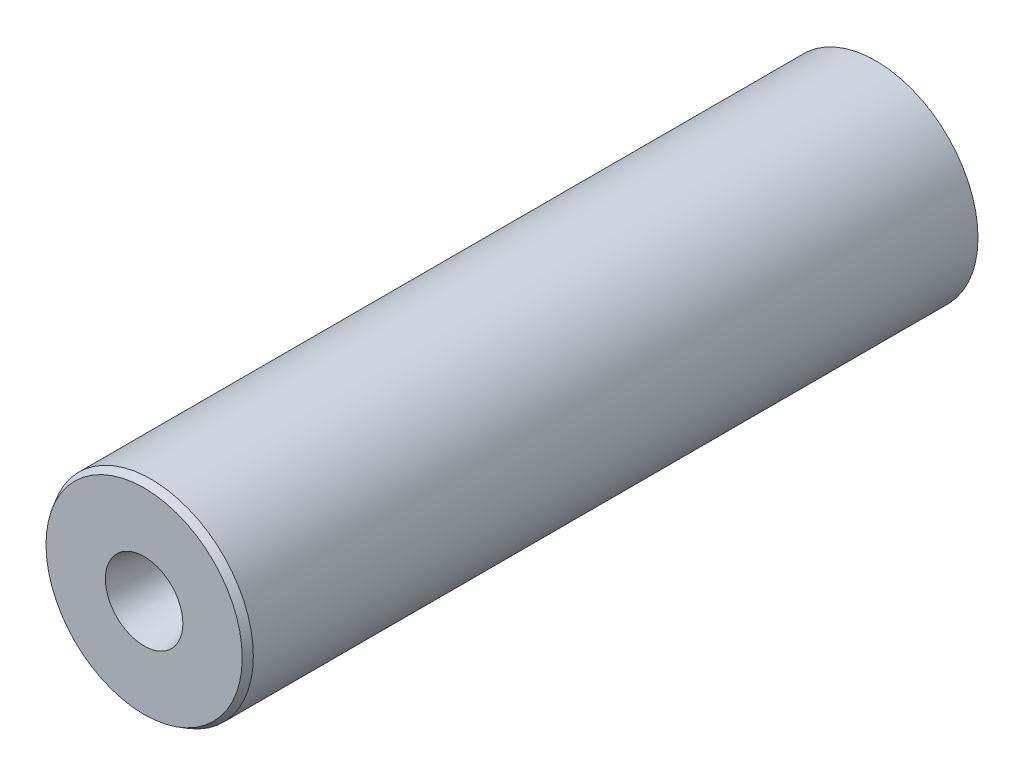
ISO-10303-21;
HEADER;
FILE_DESCRIPTION(('STEP AP214'),'2;1');
FILE_NAME('part.step','',(''),(''),'','','');
FILE_SCHEMA(('AUTOMOTIVE_DESIGN { 1 0 10303 214 1 1 1 1 }'));
ENDSEC;
DATA;
#1=APPLICATION_CONTEXT('core data for automotive mechanical design processes');
#2=APPLICATION_PROTOCOL_DEFINITION('international standard','automotive_design',2000,#1);
#3=PRODUCT_CONTEXT('',#1,'mechanical');
#4=PRODUCT('Part','Part','',(#3));
#5=PRODUCT_RELATED_PRODUCT_CATEGORY('part','',(#4));
#6=PRODUCT_DEFINITION_FORMATION('','',#4);
#7=PRODUCT_DEFINITION_CONTEXT('part definition',#1,'design');
#8=PRODUCT_DEFINITION('design','',#6,#7);
#9=PRODUCT_DEFINITION_SHAPE('','',#8);
#10=(LENGTH_UNIT() NAMED_UNIT(*) SI_UNIT(.MILLI.,.METRE.));
#11=(NAMED_UNIT(*) PLANE_ANGLE_UNIT() SI_UNIT($,.RADIAN.));
#12=(NAMED_UNIT(*) SI_UNIT($,.STERADIAN.) SOLID_ANGLE_UNIT());
#13=UNCERTAINTY_MEASURE_WITH_UNIT(LENGTH_MEASURE(1.E-05),#10,'distance_accuracy_value','');
#14=(GEOMETRIC_REPRESENTATION_CONTEXT(3) GLOBAL_UNCERTAINTY_ASSIGNED_CONTEXT((#13)) GLOBAL_UNIT_ASSIGNED_CONTEXT((#10,
#11,#12)) REPRESENTATION_CONTEXT('',''));
#15=CARTESIAN_POINT('',(0.,0.,0.));
#16=DIRECTION('',(0.,0.,1.));
#17=DIRECTION('',(1.,0.,0.));
#18=AXIS2_PLACEMENT_3D('',#15,#16,#17);
#19=CARTESIAN_POINT('',(0.,0.,51.9181610963858));
#20=DIRECTION('',(0.,0.,1.));
#21=DIRECTION('',(1.,0.,0.));
#22=AXIS2_PLACEMENT_3D('',#19,#20,#21);
#23=CYLINDRICAL_SURFACE('',#22,11.);
#24=CARTESIAN_POINT('',(0.,0.,21.7420929414587));
#25=DIRECTION('',(0.,0.,1.));
#26=DIRECTION('',(1.,0.,0.));
#27=AXIS2_PLACEMENT_3D('',#24,#25,#26);
#28=CIRCLE('',#27,11.);
#29=CARTESIAN_POINT('',(11.,0.,21.7420929414587));
#30=VERTEX_POINT('',#29);
#31=EDGE_CURVE('E54',#30,#30,#28,.T.);
#32=ORIENTED_EDGE('',*,*,#31,.T.);
#33=EDGE_LOOP('',(#32));
#34=FACE_BOUND('',#33,.T.);
#35=CARTESIAN_POINT('',(0.,0.,-36.9181610963857));
#36=DIRECTION('',(0.,0.,-1.));
#37=DIRECTION('',(0.,1.,0.));
#38=AXIS2_PLACEMENT_3D('',#35,#36,#37);
#39=CIRCLE('',#38,11.);
#40=CARTESIAN_POINT('',(0.,11.,-36.9181610963857));
#41=VERTEX_POINT('',#40);
#42=EDGE_CURVE('E58',#41,#41,#39,.F.);
#43=ORIENTED_EDGE('',*,*,#42,.F.);
#44=EDGE_LOOP('',(#43));
#45=FACE_BOUND('',#44,.T.);
#46=ADVANCED_FACE('F31',(#34,#45),#23,.F.);
#47=CARTESIAN_POINT('',(0.,0.,-51.9181610963858));
#48=DIRECTION('',(0.,0.,-1.));
#49=DIRECTION('',(-1.,0.,0.));
#50=AXIS2_PLACEMENT_3D('',#47,#48,#49);
#51=CIRCLE('',#50,11.);
#52=CARTESIAN_POINT('',(-11.,0.,-51.9181610963858));
#53=VERTEX_POINT('',#52);
#54=EDGE_CURVE('E61',#53,#53,#51,.T.);
#55=ORIENTED_EDGE('',*,*,#54,.T.);
#56=EDGE_LOOP('',(#55));
#57=FACE_BOUND('',#56,.T.);
#58=CARTESIAN_POINT('',(0.,0.,-48.9181610963857));
#59=DIRECTION('',(0.,0.,1.));
#60=DIRECTION('',(0.,-1.,0.));
#61=AXIS2_PLACEMENT_3D('',#58,#59,#60);
#62=CIRCLE('',#61,11.);
#63=CARTESIAN_POINT('',(0.,-11.,-48.9181610963857));
#64=VERTEX_POINT('',#63);
#65=EDGE_CURVE('E99',#64,#64,#62,.T.);
#66=ORIENTED_EDGE('',*,*,#65,.T.);
#67=EDGE_LOOP('',(#66));
#68=FACE_BOUND('',#67,.T.);
#69=ADVANCED_FACE('F103',(#57,#68),#23,.F.);
#70=CARTESIAN_POINT('',(0.,14.5,51.9181610963858));
#71=DIRECTION('',(0.,0.,-1.));
#72=DIRECTION('',(-1.,0.,0.));
#73=AXIS2_PLACEMENT_3D('',#70,#71,#72);
#74=PLANE('',#73);
#75=CARTESIAN_POINT('',(0.,0.,51.9181610963858));
#76=DIRECTION('',(0.,0.,-1.));
#77=DIRECTION('',(-1.,0.,0.));
#78=AXIS2_PLACEMENT_3D('',#75,#76,#77);
#79=CIRCLE('',#78,13.9226497308104);
#80=CARTESIAN_POINT('',(-13.9226497308104,0.,51.9181610963858));
#81=VERTEX_POINT('',#80);
#82=EDGE_CURVE('E38',#81,#81,#79,.F.);
#83=ORIENTED_EDGE('',*,*,#82,.T.);
#84=EDGE_LOOP('',(#83));
#85=FACE_BOUND('',#84,.T.);
#86=CARTESIAN_POINT('',(0.,0.,51.9181610963858));
#87=DIRECTION('',(0.,0.,1.));
#88=DIRECTION('',(1.,0.,0.));
#89=AXIS2_PLACEMENT_3D('',#86,#87,#88);
#90=CIRCLE('',#89,5.5);
#91=CARTESIAN_POINT('',(5.5,0.,51.9181610963858));
#92=VERTEX_POINT('',#91);
#93=EDGE_CURVE('E57',#92,#92,#90,.T.);
#94=ORIENTED_EDGE('',*,*,#93,.F.);
#95=EDGE_LOOP('',(#94));
#96=FACE_BOUND('',#95,.T.);
#97=ADVANCED_FACE('F127',(#85,#96),#74,.F.);
#98=CARTESIAN_POINT('',(0.,0.,51.9181610963858));
#99=DIRECTION('',(0.,0.,1.));
#100=DIRECTION('',(1.,0.,0.));
#101=AXIS2_PLACEMENT_3D('',#98,#99,#100);
#102=CONICAL_SURFACE('',#101,5.5,0.209439510239312);
#103=CARTESIAN_POINT('',(0.,0.,39.6816491923393));
#104=DIRECTION('',(0.,0.,-1.));
#105=DIRECTION('',(-1.,0.,0.));
#106=AXIS2_PLACEMENT_3D('',#103,#104,#105);
#107=CIRCLE('',#106,2.89904910284168);
#108=CARTESIAN_POINT('',(-2.89904910284168,0.,39.6816491923393));
#109=VERTEX_POINT('',#108);
#110=EDGE_CURVE('E42',#109,#109,#107,.T.);
#111=ORIENTED_EDGE('',*,*,#110,.T.);
#112=EDGE_LOOP('',(#111));
#113=FACE_BOUND('',#112,.T.);
#114=ORIENTED_EDGE('',*,*,#93,.T.);
#115=EDGE_LOOP('',(#114));
#116=FACE_BOUND('',#115,.T.);
#117=ADVANCED_FACE('F176',(#113,#116),#102,.F.);
#118=CARTESIAN_POINT('',(0.,0.,37.8042707679499));
#119=DIRECTION('',(0.,0.,-1.));
#120=DIRECTION('',(-1.,0.,0.));
#121=AXIS2_PLACEMENT_3D('',#118,#119,#120);
#122=CONICAL_SURFACE('',#121,2.5,0.523598775598293);
#123=CARTESIAN_POINT('',(0.,0.,24.2420929414586));
#124=DIRECTION('',(0.,0.,-1.));
#125=DIRECTION('',(-1.,0.,0.));
#126=AXIS2_PLACEMENT_3D('',#123,#124,#125);
#127=CIRCLE('',#126,10.3301270189222);
#128=CARTESIAN_POINT('',(-10.3301270189222,0.,24.2420929414586));
#129=VERTEX_POINT('',#128);
#130=EDGE_CURVE('E46',#129,#129,#127,.T.);
#131=ORIENTED_EDGE('',*,*,#130,.T.);
#132=EDGE_LOOP('',(#131));
#133=FACE_BOUND('',#132,.T.);
#134=CARTESIAN_POINT('',(0.,0.,36.1420907382506));
#135=DIRECTION('',(0.,0.,1.));
#136=DIRECTION('',(1.,0.,0.));
#137=AXIS2_PLACEMENT_3D('',#134,#135,#136);
#138=CIRCLE('',#137,3.45966008758851);
#139=CARTESIAN_POINT('',(3.45966008758851,0.,36.1420907382506));
#140=VERTEX_POINT('',#139);
#141=EDGE_CURVE('E51',#140,#140,#138,.T.);
#142=ORIENTED_EDGE('',*,*,#141,.T.);
#143=EDGE_LOOP('',(#142));
#144=FACE_BOUND('',#143,.T.);
#145=ADVANCED_FACE('F171',(#133,#144),#122,.F.);
#146=CARTESIAN_POINT('',(0.,14.5,-51.9181610963858));
#147=DIRECTION('',(0.,0.,1.));
#148=DIRECTION('',(1.,0.,0.));
#149=AXIS2_PLACEMENT_3D('',#146,#147,#148);
#150=PLANE('',#149);
#151=ORIENTED_EDGE('',*,*,#54,.F.);
#152=EDGE_LOOP('',(#151));
#153=FACE_BOUND('',#152,.T.);
#154=CARTESIAN_POINT('',(0.,0.,-51.9181610963858));
#155=DIRECTION('',(0.,0.,1.));
#156=DIRECTION('',(1.,0.,0.));
#157=AXIS2_PLACEMENT_3D('',#154,#155,#156);
#158=CIRCLE('',#157,14.5);
#159=CARTESIAN_POINT('',(14.5,0.,-51.9181610963858));
#160=VERTEX_POINT('',#159);
#161=EDGE_CURVE('E65',#160,#160,#158,.T.);
#162=ORIENTED_EDGE('',*,*,#161,.F.);
#163=EDGE_LOOP('',(#162));
#164=FACE_BOUND('',#163,.T.);
#165=ADVANCED_FACE('F169',(#153,#164),#150,.F.);
#166=CARTESIAN_POINT('',(0.,0.,51.9181610963858));
#167=DIRECTION('',(0.,0.,1.));
#168=DIRECTION('',(1.,0.,0.));
#169=AXIS2_PLACEMENT_3D('',#166,#167,#168);
#170=CYLINDRICAL_SURFACE('',#169,14.5);
#171=CARTESIAN_POINT('',(0.,0.,50.9181610963858));
#172=DIRECTION('',(0.,0.,-1.));
#173=DIRECTION('',(-1.,0.,0.));
#174=AXIS2_PLACEMENT_3D('',#171,#172,#173);
#175=CIRCLE('',#174,14.5);
#176=CARTESIAN_POINT('',(-14.5,0.,50.9181610963858));
#177=VERTEX_POINT('',#176);
#178=EDGE_CURVE('E10',#177,#177,#175,.T.);
#179=ORIENTED_EDGE('',*,*,#178,.T.);
#180=EDGE_LOOP('',(#179));
#181=FACE_BOUND('',#180,.T.);
#182=ORIENTED_EDGE('',*,*,#161,.T.);
#183=EDGE_LOOP('',(#182));
#184=FACE_BOUND('',#183,.T.);
#185=ADVANCED_FACE('F167',(#181,#184),#170,.T.);
#186=CARTESIAN_POINT('',(0.,12.,-46.9181610963857));
#187=DIRECTION('',(0.,0.,-1.));
#188=DIRECTION('',(0.,1.,0.));
#189=AXIS2_PLACEMENT_3D('',#186,#187,#188);
#190=PLANE('',#189);
#191=CARTESIAN_POINT('',(0.,0.,-46.9181610963858));
#192=DIRECTION('',(0.,0.,1.));
#193=DIRECTION('',(0.,-1.,0.));
#194=AXIS2_PLACEMENT_3D('',#191,#192,#193);
#195=CIRCLE('',#194,11.);
#196=CARTESIAN_POINT('',(0.,-11.,-46.9181610963858));
#197=VERTEX_POINT('',#196);
#198=EDGE_CURVE('E90',#197,#197,#195,.T.);
#199=ORIENTED_EDGE('',*,*,#198,.T.);
#200=EDGE_LOOP('',(#199));
#201=FACE_BOUND('',#200,.T.);
#202=CARTESIAN_POINT('',(0.,0.,-46.9181610963857));
#203=DIRECTION('',(0.,0.,1.));
#204=DIRECTION('',(0.,-1.,0.));
#205=AXIS2_PLACEMENT_3D('',#202,#203,#204);
#206=CIRCLE('',#205,12.);
#207=CARTESIAN_POINT('',(0.,-12.,-46.9181610963857));
#208=VERTEX_POINT('',#207);
#209=EDGE_CURVE('E93',#208,#208,#206,.T.);
#210=ORIENTED_EDGE('',*,*,#209,.F.);
#211=EDGE_LOOP('',(#210));
#212=FACE_BOUND('',#211,.T.);
#213=ADVANCED_FACE('F119',(#201,#212),#190,.T.);
#214=CARTESIAN_POINT('',(0.,0.,0.));
#215=DIRECTION('',(0.,0.,1.));
#216=DIRECTION('',(0.,-1.,0.));
#217=AXIS2_PLACEMENT_3D('',#214,#215,#216);
#218=CYLINDRICAL_SURFACE('',#217,12.);
#219=ORIENTED_EDGE('',*,*,#209,.T.);
#220=EDGE_LOOP('',(#219));
#221=FACE_BOUND('',#220,.T.);
#222=CARTESIAN_POINT('',(0.,0.,-48.9181610963857));
#223=DIRECTION('',(0.,0.,1.));
#224=DIRECTION('',(0.,-1.,0.));
#225=AXIS2_PLACEMENT_3D('',#222,#223,#224);
#226=CIRCLE('',#225,12.);
#227=CARTESIAN_POINT('',(0.,-12.,-48.9181610963857));
#228=VERTEX_POINT('',#227);
#229=EDGE_CURVE('E96',#228,#228,#226,.T.);
#230=ORIENTED_EDGE('',*,*,#229,.F.);
#231=EDGE_LOOP('',(#230));
#232=FACE_BOUND('',#231,.T.);
#233=ADVANCED_FACE('F108',(#221,#232),#218,.F.);
#234=CARTESIAN_POINT('',(0.,11.,-48.9181610963857));
#235=DIRECTION('',(0.,0.,1.));
#236=DIRECTION('',(0.,-1.,0.));
#237=AXIS2_PLACEMENT_3D('',#234,#235,#236);
#238=PLANE('',#237);
#239=ORIENTED_EDGE('',*,*,#229,.T.);
#240=EDGE_LOOP('',(#239));
#241=FACE_BOUND('',#240,.T.);
#242=ORIENTED_EDGE('',*,*,#65,.F.);
#243=EDGE_LOOP('',(#242));
#244=FACE_BOUND('',#243,.T.);
#245=ADVANCED_FACE('F105',(#241,#244),#238,.T.);
#246=ORIENTED_EDGE('',*,*,#198,.F.);
#247=EDGE_LOOP('',(#246));
#248=FACE_BOUND('',#247,.T.);
#249=CARTESIAN_POINT('',(0.,0.,-43.9181610963858));
#250=DIRECTION('',(0.,0.,1.));
#251=DIRECTION('',(0.,-1.,0.));
#252=AXIS2_PLACEMENT_3D('',#249,#250,#251);
#253=CIRCLE('',#252,11.);
#254=CARTESIAN_POINT('',(0.,-11.,-43.9181610963858));
#255=VERTEX_POINT('',#254);
#256=EDGE_CURVE('E87',#255,#255,#253,.T.);
#257=ORIENTED_EDGE('',*,*,#256,.T.);
#258=EDGE_LOOP('',(#257));
#259=FACE_BOUND('',#258,.T.);
#260=ADVANCED_FACE('F107',(#248,#259),#23,.F.);
#261=CARTESIAN_POINT('',(0.,12.,-41.9181610963858));
#262=DIRECTION('',(0.,0.,-1.));
#263=DIRECTION('',(0.,1.,0.));
#264=AXIS2_PLACEMENT_3D('',#261,#262,#263);
#265=PLANE('',#264);
#266=CARTESIAN_POINT('',(0.,0.,-41.9181610963858));
#267=DIRECTION('',(0.,0.,1.));
#268=DIRECTION('',(0.,-1.,0.));
#269=AXIS2_PLACEMENT_3D('',#266,#267,#268);
#270=CIRCLE('',#269,11.);
#271=CARTESIAN_POINT('',(0.,-11.,-41.9181610963858));
#272=VERTEX_POINT('',#271);
#273=EDGE_CURVE('E78',#272,#272,#270,.T.);
#274=ORIENTED_EDGE('',*,*,#273,.T.);
#275=EDGE_LOOP('',(#274));
#276=FACE_BOUND('',#275,.T.);
#277=CARTESIAN_POINT('',(0.,0.,-41.9181610963858));
#278=DIRECTION('',(0.,0.,1.));
#279=DIRECTION('',(0.,-1.,0.));
#280=AXIS2_PLACEMENT_3D('',#277,#278,#279);
#281=CIRCLE('',#280,12.);
#282=CARTESIAN_POINT('',(0.,-12.,-41.9181610963858));
#283=VERTEX_POINT('',#282);
#284=EDGE_CURVE('E81',#283,#283,#281,.T.);
#285=ORIENTED_EDGE('',*,*,#284,.F.);
#286=EDGE_LOOP('',(#285));
#287=FACE_BOUND('',#286,.T.);
#288=ADVANCED_FACE('F115',(#276,#287),#265,.T.);
#289=CARTESIAN_POINT('',(0.,0.,0.));
#290=DIRECTION('',(0.,0.,1.));
#291=DIRECTION('',(0.,-1.,0.));
#292=AXIS2_PLACEMENT_3D('',#289,#290,#291);
#293=CYLINDRICAL_SURFACE('',#292,12.);
#294=ORIENTED_EDGE('',*,*,#284,.T.);
#295=EDGE_LOOP('',(#294));
#296=FACE_BOUND('',#295,.T.);
#297=CARTESIAN_POINT('',(0.,0.,-43.9181610963858));
#298=DIRECTION('',(0.,0.,1.));
#299=DIRECTION('',(0.,-1.,0.));
#300=AXIS2_PLACEMENT_3D('',#297,#298,#299);
#301=CIRCLE('',#300,12.);
#302=CARTESIAN_POINT('',(0.,-12.,-43.9181610963858));
#303=VERTEX_POINT('',#302);
#304=EDGE_CURVE('E84',#303,#303,#301,.T.);
#305=ORIENTED_EDGE('',*,*,#304,.F.);
#306=EDGE_LOOP('',(#305));
#307=FACE_BOUND('',#306,.T.);
#308=ADVANCED_FACE('F143',(#296,#307),#293,.F.);
#309=CARTESIAN_POINT('',(0.,11.,-43.9181610963858));
#310=DIRECTION('',(0.,0.,1.));
#311=DIRECTION('',(0.,-1.,0.));
#312=AXIS2_PLACEMENT_3D('',#309,#310,#311);
#313=PLANE('',#312);
#314=ORIENTED_EDGE('',*,*,#304,.T.);
#315=EDGE_LOOP('',(#314));
#316=FACE_BOUND('',#315,.T.);
#317=ORIENTED_EDGE('',*,*,#256,.F.);
#318=EDGE_LOOP('',(#317));
#319=FACE_BOUND('',#318,.T.);
#320=ADVANCED_FACE('F134',(#316,#319),#313,.T.);
#321=ORIENTED_EDGE('',*,*,#273,.F.);
#322=EDGE_LOOP('',(#321));
#323=FACE_BOUND('',#322,.T.);
#324=CARTESIAN_POINT('',(0.,0.,-38.9181610963857));
#325=DIRECTION('',(0.,0.,1.));
#326=DIRECTION('',(0.,-1.,0.));
#327=AXIS2_PLACEMENT_3D('',#324,#325,#326);
#328=CIRCLE('',#327,11.);
#329=CARTESIAN_POINT('',(0.,-11.,-38.9181610963857));
#330=VERTEX_POINT('',#329);
#331=EDGE_CURVE('E75',#330,#330,#328,.T.);
#332=ORIENTED_EDGE('',*,*,#331,.T.);
#333=EDGE_LOOP('',(#332));
#334=FACE_BOUND('',#333,.T.);
#335=ADVANCED_FACE('F118',(#323,#334),#23,.F.);
#336=CARTESIAN_POINT('',(0.,12.,-36.9181610963857));
#337=DIRECTION('',(0.,0.,-1.));
#338=DIRECTION('',(0.,1.,0.));
#339=AXIS2_PLACEMENT_3D('',#336,#337,#338);
#340=PLANE('',#339);
#341=CARTESIAN_POINT('',(0.,0.,-36.9181610963857));
#342=DIRECTION('',(0.,0.,1.));
#343=DIRECTION('',(0.,-1.,0.));
#344=AXIS2_PLACEMENT_3D('',#341,#342,#343);
#345=CIRCLE('',#344,12.);
#346=CARTESIAN_POINT('',(0.,-12.,-36.9181610963857));
#347=VERTEX_POINT('',#346);
#348=EDGE_CURVE('E62',#347,#347,#345,.T.);
#349=ORIENTED_EDGE('',*,*,#348,.F.);
#350=EDGE_LOOP('',(#349));
#351=FACE_BOUND('',#350,.T.);
#352=ORIENTED_EDGE('',*,*,#42,.T.);
#353=EDGE_LOOP('',(#352));
#354=FACE_BOUND('',#353,.T.);
#355=ADVANCED_FACE('F133',(#351,#354),#340,.T.);
#356=CARTESIAN_POINT('',(0.,0.,0.));
#357=DIRECTION('',(0.,0.,1.));
#358=DIRECTION('',(0.,-1.,0.));
#359=AXIS2_PLACEMENT_3D('',#356,#357,#358);
#360=CYLINDRICAL_SURFACE('',#359,12.);
#361=ORIENTED_EDGE('',*,*,#348,.T.);
#362=EDGE_LOOP('',(#361));
#363=FACE_BOUND('',#362,.T.);
#364=CARTESIAN_POINT('',(0.,0.,-38.9181610963857));
#365=DIRECTION('',(0.,0.,1.));
#366=DIRECTION('',(0.,-1.,0.));
#367=AXIS2_PLACEMENT_3D('',#364,#365,#366);
#368=CIRCLE('',#367,12.);
#369=CARTESIAN_POINT('',(0.,-12.,-38.9181610963857));
#370=VERTEX_POINT('',#369);
#371=EDGE_CURVE('E72',#370,#370,#368,.T.);
#372=ORIENTED_EDGE('',*,*,#371,.F.);
#373=EDGE_LOOP('',(#372));
#374=FACE_BOUND('',#373,.T.);
#375=ADVANCED_FACE('F140',(#363,#374),#360,.F.);
#376=CARTESIAN_POINT('',(0.,11.,-38.9181610963857));
#377=DIRECTION('',(0.,0.,1.));
#378=DIRECTION('',(0.,-1.,0.));
#379=AXIS2_PLACEMENT_3D('',#376,#377,#378);
#380=PLANE('',#379);
#381=ORIENTED_EDGE('',*,*,#371,.T.);
#382=EDGE_LOOP('',(#381));
#383=FACE_BOUND('',#382,.T.);
#384=ORIENTED_EDGE('',*,*,#331,.F.);
#385=EDGE_LOOP('',(#384));
#386=FACE_BOUND('',#385,.T.);
#387=ADVANCED_FACE('F150',(#383,#386),#380,.T.);
#388=CARTESIAN_POINT('',(0.,0.,21.7420929414587));
#389=DIRECTION('',(0.,0.,1.));
#390=DIRECTION('',(1.,0.,0.));
#391=AXIS2_PLACEMENT_3D('',#388,#389,#390);
#392=TOROIDAL_SURFACE('',#391,6.,5.);
#393=ORIENTED_EDGE('',*,*,#130,.F.);
#394=EDGE_LOOP('',(#393));
#395=FACE_BOUND('',#394,.T.);
#396=ORIENTED_EDGE('',*,*,#31,.F.);
#397=EDGE_LOOP('',(#396));
#398=FACE_BOUND('',#397,.T.);
#399=ADVANCED_FACE('F152',(#395,#398),#392,.F.);
#400=CARTESIAN_POINT('',(0.,0.,38.6420907382505));
#401=DIRECTION('',(0.,0.,-1.));
#402=DIRECTION('',(-1.,0.,0.));
#403=AXIS2_PLACEMENT_3D('',#400,#401,#402);
#404=TOROIDAL_SURFACE('',#403,7.78978710651072,5.);
#405=ORIENTED_EDGE('',*,*,#110,.F.);
#406=EDGE_LOOP('',(#405));
#407=FACE_BOUND('',#406,.T.);
#408=ORIENTED_EDGE('',*,*,#141,.F.);
#409=EDGE_LOOP('',(#408));
#410=FACE_BOUND('',#409,.T.);
#411=ADVANCED_FACE('F159',(#407,#410),#404,.T.);
#412=CARTESIAN_POINT('',(0.,0.,51.9181610963858));
#413=DIRECTION('',(0.,0.,-1.));
#414=DIRECTION('',(-1.,0.,0.));
#415=AXIS2_PLACEMENT_3D('',#412,#413,#414);
#416=CONICAL_SURFACE('',#415,13.9226497308104,0.523598775598293);
#417=ORIENTED_EDGE('',*,*,#178,.F.);
#418=EDGE_LOOP('',(#417));
#419=FACE_BOUND('',#418,.T.);
#420=ORIENTED_EDGE('',*,*,#82,.F.);
#421=EDGE_LOOP('',(#420));
#422=FACE_BOUND('',#421,.T.);
#423=ADVANCED_FACE('F33',(#419,#422),#416,.T.);
#424=CLOSED_SHELL('',(#46,#69,#97,#117,#145,#165,#185,#213,#233,#245,#260,#288,#308,#320,#335,
#355,#375,#387,#399,#411,#423));
#425=MANIFOLD_SOLID_BREP('B2',#424);
#426=ADVANCED_BREP_SHAPE_REPRESENTATION('',(#18,#425),#14);
#427=SHAPE_DEFINITION_REPRESENTATION(#9,#426);
ENDSEC;
END-ISO-10303-21;
